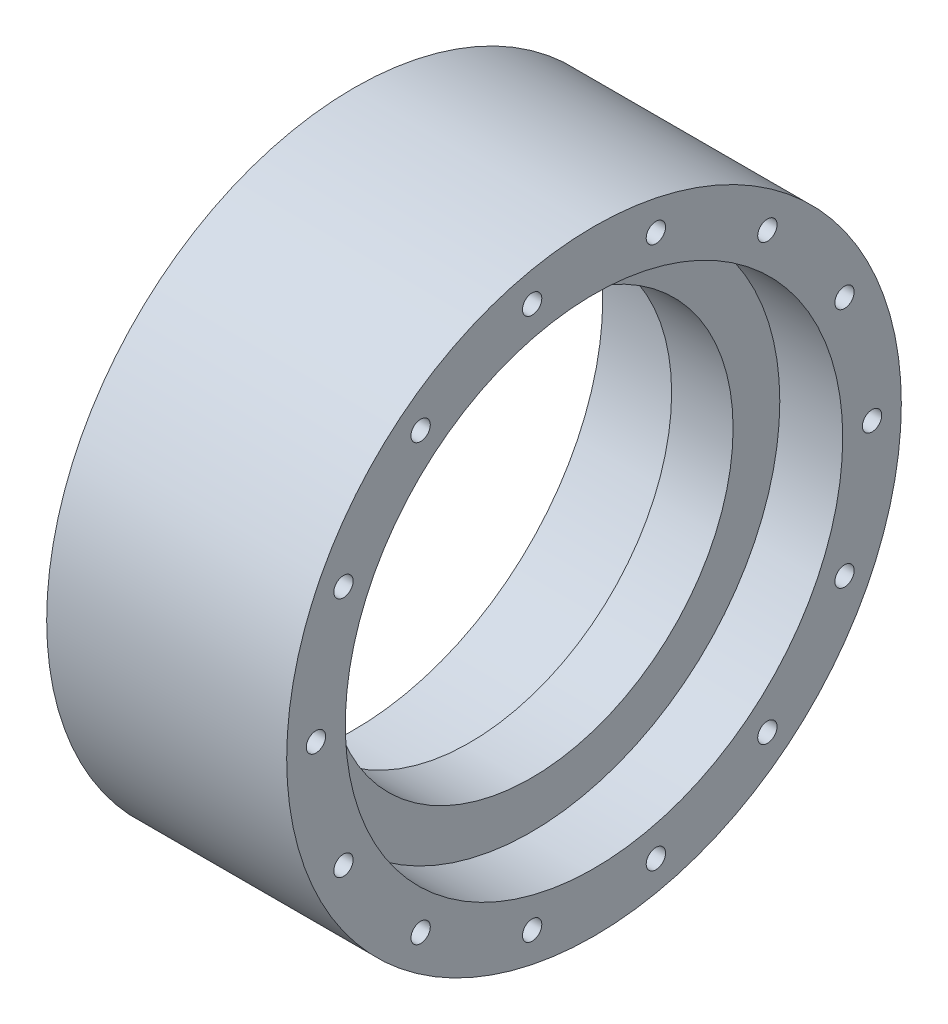
ISO-10303-21;
HEADER;
FILE_DESCRIPTION(('STEP AP214'),'2;1');
FILE_NAME('part.step','',(''),(''),'','','');
FILE_SCHEMA(('AUTOMOTIVE_DESIGN { 1 0 10303 214 1 1 1 1 }'));
ENDSEC;
DATA;
#1=APPLICATION_CONTEXT('core data for automotive mechanical design processes');
#2=APPLICATION_PROTOCOL_DEFINITION('international standard','automotive_design',2000,#1);
#3=PRODUCT_CONTEXT('',#1,'mechanical');
#4=PRODUCT('Part','Part','',(#3));
#5=PRODUCT_RELATED_PRODUCT_CATEGORY('part','',(#4));
#6=PRODUCT_DEFINITION_FORMATION('','',#4);
#7=PRODUCT_DEFINITION_CONTEXT('part definition',#1,'design');
#8=PRODUCT_DEFINITION('design','',#6,#7);
#9=PRODUCT_DEFINITION_SHAPE('','',#8);
#10=(LENGTH_UNIT() NAMED_UNIT(*) SI_UNIT(.MILLI.,.METRE.));
#11=(NAMED_UNIT(*) PLANE_ANGLE_UNIT() SI_UNIT($,.RADIAN.));
#12=(NAMED_UNIT(*) SI_UNIT($,.STERADIAN.) SOLID_ANGLE_UNIT());
#13=UNCERTAINTY_MEASURE_WITH_UNIT(LENGTH_MEASURE(1.E-05),#10,'distance_accuracy_value','');
#14=(GEOMETRIC_REPRESENTATION_CONTEXT(3) GLOBAL_UNCERTAINTY_ASSIGNED_CONTEXT((#13)) GLOBAL_UNIT_ASSIGNED_CONTEXT((#10,
#11,#12)) REPRESENTATION_CONTEXT('',''));
#15=CARTESIAN_POINT('',(0.,0.,0.));
#16=DIRECTION('',(0.,0.,1.));
#17=DIRECTION('',(1.,0.,0.));
#18=AXIS2_PLACEMENT_3D('',#15,#16,#17);
#19=CARTESIAN_POINT('',(0.5,0.,0.));
#20=DIRECTION('',(1.,0.,0.));
#21=DIRECTION('',(0.,1.,0.));
#22=AXIS2_PLACEMENT_3D('',#19,#20,#21);
#23=PLANE('',#22);
#24=CARTESIAN_POINT('',(0.5,0.,-47.5));
#25=DIRECTION('',(1.,0.,0.));
#26=DIRECTION('',(0.,0.,-1.));
#27=AXIS2_PLACEMENT_3D('',#24,#25,#26);
#28=CIRCLE('',#27,1.65);
#29=CARTESIAN_POINT('',(0.5,0.,-49.15));
#30=VERTEX_POINT('',#29);
#31=EDGE_CURVE('E11',#30,#30,#28,.T.);
#32=ORIENTED_EDGE('',*,*,#31,.T.);
#33=EDGE_LOOP('',(#32));
#34=FACE_BOUND('',#33,.T.);
#35=ADVANCED_FACE('F16',(#34),#23,.T.);
#36=CARTESIAN_POINT('',(0.5,0.,-47.5));
#37=DIRECTION('',(1.,0.,0.));
#38=DIRECTION('',(0.,0.,-1.));
#39=AXIS2_PLACEMENT_3D('',#36,#37,#38);
#40=CYLINDRICAL_SURFACE('',#39,1.65);
#41=CARTESIAN_POINT('',(20.5,0.,-47.5));
#42=DIRECTION('',(1.,0.,0.));
#43=DIRECTION('',(0.,0.,-1.));
#44=AXIS2_PLACEMENT_3D('',#41,#42,#43);
#45=CIRCLE('',#44,1.65);
#46=CARTESIAN_POINT('',(20.5,0.,-49.15));
#47=VERTEX_POINT('',#46);
#48=EDGE_CURVE('E271',#47,#47,#45,.T.);
#49=ORIENTED_EDGE('',*,*,#48,.T.);
#50=EDGE_LOOP('',(#49));
#51=FACE_BOUND('',#50,.T.);
#52=ORIENTED_EDGE('',*,*,#31,.F.);
#53=EDGE_LOOP('',(#52));
#54=FACE_BOUND('',#53,.T.);
#55=ADVANCED_FACE('F398',(#51,#54),#40,.F.);
#56=CARTESIAN_POINT('',(0.5,0.,0.));
#57=DIRECTION('',(1.,0.,0.));
#58=DIRECTION('',(0.,1.,0.));
#59=AXIS2_PLACEMENT_3D('',#56,#57,#58);
#60=PLANE('',#59);
#61=CARTESIAN_POINT('',(0.5,-46.3090758286366,10.5697443629249));
#62=DIRECTION('',(1.,0.,0.));
#63=DIRECTION('',(0.,0.,-1.));
#64=AXIS2_PLACEMENT_3D('',#61,#62,#63);
#65=CIRCLE('',#64,1.65);
#66=CARTESIAN_POINT('',(0.5,-46.3090758286366,8.91974436292494));
#67=VERTEX_POINT('',#66);
#68=EDGE_CURVE('E27',#67,#67,#65,.T.);
#69=ORIENTED_EDGE('',*,*,#68,.T.);
#70=EDGE_LOOP('',(#69));
#71=FACE_BOUND('',#70,.T.);
#72=ADVANCED_FACE('F402',(#71),#60,.T.);
#73=CARTESIAN_POINT('',(0.5,-46.3090758286366,10.5697443629249));
#74=DIRECTION('',(1.,0.,0.));
#75=DIRECTION('',(0.,0.,-1.));
#76=AXIS2_PLACEMENT_3D('',#73,#74,#75);
#77=CYLINDRICAL_SURFACE('',#76,1.65);
#78=CARTESIAN_POINT('',(20.5,-46.3090758286366,10.5697443629249));
#79=DIRECTION('',(1.,0.,0.));
#80=DIRECTION('',(0.,0.,-1.));
#81=AXIS2_PLACEMENT_3D('',#78,#79,#80);
#82=CIRCLE('',#81,1.65);
#83=CARTESIAN_POINT('',(20.5,-46.3090758286366,8.91974436292494));
#84=VERTEX_POINT('',#83);
#85=EDGE_CURVE('E219',#84,#84,#82,.T.);
#86=ORIENTED_EDGE('',*,*,#85,.T.);
#87=EDGE_LOOP('',(#86));
#88=FACE_BOUND('',#87,.T.);
#89=ORIENTED_EDGE('',*,*,#68,.F.);
#90=EDGE_LOOP('',(#89));
#91=FACE_BOUND('',#90,.T.);
#92=ADVANCED_FACE('F435',(#88,#91),#77,.F.);
#93=CARTESIAN_POINT('',(0.5,0.,0.));
#94=DIRECTION('',(1.,0.,0.));
#95=DIRECTION('',(0.,1.,0.));
#96=AXIS2_PLACEMENT_3D('',#93,#94,#95);
#97=PLANE('',#96);
#98=CARTESIAN_POINT('',(0.5,-46.3090758286366,-10.5697443629249));
#99=DIRECTION('',(1.,0.,0.));
#100=DIRECTION('',(0.,0.,-1.));
#101=AXIS2_PLACEMENT_3D('',#98,#99,#100);
#102=CIRCLE('',#101,1.65);
#103=CARTESIAN_POINT('',(0.5,-46.3090758286366,-12.2197443629249));
#104=VERTEX_POINT('',#103);
#105=EDGE_CURVE('E237',#104,#104,#102,.T.);
#106=ORIENTED_EDGE('',*,*,#105,.T.);
#107=EDGE_LOOP('',(#106));
#108=FACE_BOUND('',#107,.T.);
#109=ADVANCED_FACE('F477',(#108),#97,.T.);
#110=CARTESIAN_POINT('',(0.5,-46.3090758286366,-10.5697443629249));
#111=DIRECTION('',(1.,0.,0.));
#112=DIRECTION('',(0.,0.,-1.));
#113=AXIS2_PLACEMENT_3D('',#110,#111,#112);
#114=CYLINDRICAL_SURFACE('',#113,1.65);
#115=CARTESIAN_POINT('',(20.5,-46.3090758286366,-10.5697443629249));
#116=DIRECTION('',(1.,0.,0.));
#117=DIRECTION('',(0.,0.,-1.));
#118=AXIS2_PLACEMENT_3D('',#115,#116,#117);
#119=CIRCLE('',#118,1.65);
#120=CARTESIAN_POINT('',(20.5,-46.3090758286366,-12.2197443629249));
#121=VERTEX_POINT('',#120);
#122=EDGE_CURVE('E216',#121,#121,#119,.T.);
#123=ORIENTED_EDGE('',*,*,#122,.T.);
#124=EDGE_LOOP('',(#123));
#125=FACE_BOUND('',#124,.T.);
#126=ORIENTED_EDGE('',*,*,#105,.F.);
#127=EDGE_LOOP('',(#126));
#128=FACE_BOUND('',#127,.T.);
#129=ADVANCED_FACE('F482',(#125,#128),#114,.F.);
#130=CARTESIAN_POINT('',(0.5,0.,0.));
#131=DIRECTION('',(1.,0.,0.));
#132=DIRECTION('',(0.,1.,0.));
#133=AXIS2_PLACEMENT_3D('',#130,#131,#132);
#134=PLANE('',#133);
#135=CARTESIAN_POINT('',(0.5,-37.1369954172314,-29.6157655882898));
#136=DIRECTION('',(1.,0.,0.));
#137=DIRECTION('',(0.,0.,-1.));
#138=AXIS2_PLACEMENT_3D('',#135,#136,#137);
#139=CIRCLE('',#138,1.65);
#140=CARTESIAN_POINT('',(0.5,-37.1369954172314,-31.2657655882898));
#141=VERTEX_POINT('',#140);
#142=EDGE_CURVE('E130',#141,#141,#139,.T.);
#143=ORIENTED_EDGE('',*,*,#142,.T.);
#144=EDGE_LOOP('',(#143));
#145=FACE_BOUND('',#144,.T.);
#146=ADVANCED_FACE('F440',(#145),#134,.T.);
#147=CARTESIAN_POINT('',(0.5,-37.1369954172314,-29.6157655882898));
#148=DIRECTION('',(1.,0.,0.));
#149=DIRECTION('',(0.,0.,-1.));
#150=AXIS2_PLACEMENT_3D('',#147,#148,#149);
#151=CYLINDRICAL_SURFACE('',#150,1.65);
#152=CARTESIAN_POINT('',(20.5,-37.1369954172314,-29.6157655882898));
#153=DIRECTION('',(1.,0.,0.));
#154=DIRECTION('',(0.,0.,-1.));
#155=AXIS2_PLACEMENT_3D('',#152,#153,#154);
#156=CIRCLE('',#155,1.65);
#157=CARTESIAN_POINT('',(20.5,-37.1369954172314,-31.2657655882898));
#158=VERTEX_POINT('',#157);
#159=EDGE_CURVE('E205',#158,#158,#156,.T.);
#160=ORIENTED_EDGE('',*,*,#159,.T.);
#161=EDGE_LOOP('',(#160));
#162=FACE_BOUND('',#161,.T.);
#163=ORIENTED_EDGE('',*,*,#142,.F.);
#164=EDGE_LOOP('',(#163));
#165=FACE_BOUND('',#164,.T.);
#166=ADVANCED_FACE('F437',(#162,#165),#151,.F.);
#167=CARTESIAN_POINT('',(0.5,0.,0.));
#168=DIRECTION('',(1.,0.,0.));
#169=DIRECTION('',(0.,1.,0.));
#170=AXIS2_PLACEMENT_3D('',#167,#168,#169);
#171=PLANE('',#170);
#172=CARTESIAN_POINT('',(0.5,-20.609477608084,-42.7960212253649));
#173=DIRECTION('',(1.,0.,0.));
#174=DIRECTION('',(0.,0.,-1.));
#175=AXIS2_PLACEMENT_3D('',#172,#173,#174);
#176=CIRCLE('',#175,1.65);
#177=CARTESIAN_POINT('',(0.5,-20.609477608084,-44.4460212253649));
#178=VERTEX_POINT('',#177);
#179=EDGE_CURVE('E140',#178,#178,#176,.T.);
#180=ORIENTED_EDGE('',*,*,#179,.T.);
#181=EDGE_LOOP('',(#180));
#182=FACE_BOUND('',#181,.T.);
#183=ADVANCED_FACE('F431',(#182),#171,.T.);
#184=CARTESIAN_POINT('',(0.5,-20.609477608084,-42.7960212253649));
#185=DIRECTION('',(1.,0.,0.));
#186=DIRECTION('',(0.,0.,-1.));
#187=AXIS2_PLACEMENT_3D('',#184,#185,#186);
#188=CYLINDRICAL_SURFACE('',#187,1.65);
#189=CARTESIAN_POINT('',(20.5,-20.609477608084,-42.7960212253649));
#190=DIRECTION('',(1.,0.,0.));
#191=DIRECTION('',(0.,0.,-1.));
#192=AXIS2_PLACEMENT_3D('',#189,#190,#191);
#193=CIRCLE('',#192,1.65);
#194=CARTESIAN_POINT('',(20.5,-20.609477608084,-44.4460212253649));
#195=VERTEX_POINT('',#194);
#196=EDGE_CURVE('E196',#195,#195,#193,.T.);
#197=ORIENTED_EDGE('',*,*,#196,.T.);
#198=EDGE_LOOP('',(#197));
#199=FACE_BOUND('',#198,.T.);
#200=ORIENTED_EDGE('',*,*,#179,.F.);
#201=EDGE_LOOP('',(#200));
#202=FACE_BOUND('',#201,.T.);
#203=ADVANCED_FACE('F427',(#199,#202),#188,.F.);
#204=CARTESIAN_POINT('',(0.5,0.,0.));
#205=DIRECTION('',(1.,0.,0.));
#206=DIRECTION('',(0.,1.,0.));
#207=AXIS2_PLACEMENT_3D('',#204,#205,#206);
#208=PLANE('',#207);
#209=CARTESIAN_POINT('',(0.5,20.609477608084,-42.7960212253649));
#210=DIRECTION('',(1.,0.,0.));
#211=DIRECTION('',(0.,0.,-1.));
#212=AXIS2_PLACEMENT_3D('',#209,#210,#211);
#213=CIRCLE('',#212,1.65);
#214=CARTESIAN_POINT('',(0.5,20.609477608084,-44.4460212253649));
#215=VERTEX_POINT('',#214);
#216=EDGE_CURVE('E244',#215,#215,#213,.T.);
#217=ORIENTED_EDGE('',*,*,#216,.T.);
#218=EDGE_LOOP('',(#217));
#219=FACE_BOUND('',#218,.T.);
#220=ADVANCED_FACE('F430',(#219),#208,.T.);
#221=CARTESIAN_POINT('',(0.5,20.609477608084,-42.7960212253649));
#222=DIRECTION('',(1.,0.,0.));
#223=DIRECTION('',(0.,0.,-1.));
#224=AXIS2_PLACEMENT_3D('',#221,#222,#223);
#225=CYLINDRICAL_SURFACE('',#224,1.65);
#226=CARTESIAN_POINT('',(20.5,20.609477608084,-42.7960212253649));
#227=DIRECTION('',(1.,0.,0.));
#228=DIRECTION('',(0.,0.,-1.));
#229=AXIS2_PLACEMENT_3D('',#226,#227,#228);
#230=CIRCLE('',#229,1.65);
#231=CARTESIAN_POINT('',(20.5,20.609477608084,-44.4460212253649));
#232=VERTEX_POINT('',#231);
#233=EDGE_CURVE('E190',#232,#232,#230,.T.);
#234=ORIENTED_EDGE('',*,*,#233,.T.);
#235=EDGE_LOOP('',(#234));
#236=FACE_BOUND('',#235,.T.);
#237=ORIENTED_EDGE('',*,*,#216,.F.);
#238=EDGE_LOOP('',(#237));
#239=FACE_BOUND('',#238,.T.);
#240=ADVANCED_FACE('F191',(#236,#239),#225,.F.);
#241=CARTESIAN_POINT('',(0.5,0.,0.));
#242=DIRECTION('',(1.,0.,0.));
#243=DIRECTION('',(0.,1.,0.));
#244=AXIS2_PLACEMENT_3D('',#241,#242,#243);
#245=PLANE('',#244);
#246=CARTESIAN_POINT('',(0.5,37.1369954172314,-29.6157655882898));
#247=DIRECTION('',(1.,0.,0.));
#248=DIRECTION('',(0.,0.,-1.));
#249=AXIS2_PLACEMENT_3D('',#246,#247,#248);
#250=CIRCLE('',#249,1.65);
#251=CARTESIAN_POINT('',(0.5,37.1369954172314,-31.2657655882898));
#252=VERTEX_POINT('',#251);
#253=EDGE_CURVE('E234',#252,#252,#250,.T.);
#254=ORIENTED_EDGE('',*,*,#253,.T.);
#255=EDGE_LOOP('',(#254));
#256=FACE_BOUND('',#255,.T.);
#257=ADVANCED_FACE('F411',(#256),#245,.T.);
#258=CARTESIAN_POINT('',(0.5,37.1369954172314,-29.6157655882898));
#259=DIRECTION('',(1.,0.,0.));
#260=DIRECTION('',(0.,0.,-1.));
#261=AXIS2_PLACEMENT_3D('',#258,#259,#260);
#262=CYLINDRICAL_SURFACE('',#261,1.65);
#263=CARTESIAN_POINT('',(20.5,37.1369954172314,-29.6157655882898));
#264=DIRECTION('',(1.,0.,0.));
#265=DIRECTION('',(0.,0.,-1.));
#266=AXIS2_PLACEMENT_3D('',#263,#264,#265);
#267=CIRCLE('',#266,1.65);
#268=CARTESIAN_POINT('',(20.5,37.1369954172314,-31.2657655882898));
#269=VERTEX_POINT('',#268);
#270=EDGE_CURVE('E195',#269,#269,#267,.T.);
#271=ORIENTED_EDGE('',*,*,#270,.T.);
#272=EDGE_LOOP('',(#271));
#273=FACE_BOUND('',#272,.T.);
#274=ORIENTED_EDGE('',*,*,#253,.F.);
#275=EDGE_LOOP('',(#274));
#276=FACE_BOUND('',#275,.T.);
#277=ADVANCED_FACE('F407',(#273,#276),#262,.F.);
#278=CARTESIAN_POINT('',(0.5,0.,0.));
#279=DIRECTION('',(1.,0.,0.));
#280=DIRECTION('',(0.,1.,0.));
#281=AXIS2_PLACEMENT_3D('',#278,#279,#280);
#282=PLANE('',#281);
#283=CARTESIAN_POINT('',(0.5,46.3090758286366,-10.5697443629249));
#284=DIRECTION('',(1.,0.,0.));
#285=DIRECTION('',(0.,0.,-1.));
#286=AXIS2_PLACEMENT_3D('',#283,#284,#285);
#287=CIRCLE('',#286,1.65);
#288=CARTESIAN_POINT('',(0.5,46.3090758286366,-12.2197443629249));
#289=VERTEX_POINT('',#288);
#290=EDGE_CURVE('E231',#289,#289,#287,.T.);
#291=ORIENTED_EDGE('',*,*,#290,.T.);
#292=EDGE_LOOP('',(#291));
#293=FACE_BOUND('',#292,.T.);
#294=ADVANCED_FACE('F410',(#293),#282,.T.);
#295=CARTESIAN_POINT('',(0.5,46.3090758286366,-10.5697443629249));
#296=DIRECTION('',(1.,0.,0.));
#297=DIRECTION('',(0.,0.,-1.));
#298=AXIS2_PLACEMENT_3D('',#295,#296,#297);
#299=CYLINDRICAL_SURFACE('',#298,1.65);
#300=CARTESIAN_POINT('',(20.5,46.3090758286366,-10.5697443629249));
#301=DIRECTION('',(1.,0.,0.));
#302=DIRECTION('',(0.,0.,-1.));
#303=AXIS2_PLACEMENT_3D('',#300,#301,#302);
#304=CIRCLE('',#303,1.65);
#305=CARTESIAN_POINT('',(20.5,46.3090758286366,-12.2197443629249));
#306=VERTEX_POINT('',#305);
#307=EDGE_CURVE('E203',#306,#306,#304,.T.);
#308=ORIENTED_EDGE('',*,*,#307,.T.);
#309=EDGE_LOOP('',(#308));
#310=FACE_BOUND('',#309,.T.);
#311=ORIENTED_EDGE('',*,*,#290,.F.);
#312=EDGE_LOOP('',(#311));
#313=FACE_BOUND('',#312,.T.);
#314=ADVANCED_FACE('F446',(#310,#313),#299,.F.);
#315=CARTESIAN_POINT('',(0.5,0.,0.));
#316=DIRECTION('',(1.,0.,0.));
#317=DIRECTION('',(0.,1.,0.));
#318=AXIS2_PLACEMENT_3D('',#315,#316,#317);
#319=PLANE('',#318);
#320=CARTESIAN_POINT('',(0.5,46.3090758286366,10.5697443629249));
#321=DIRECTION('',(1.,0.,0.));
#322=DIRECTION('',(0.,0.,-1.));
#323=AXIS2_PLACEMENT_3D('',#320,#321,#322);
#324=CIRCLE('',#323,1.65);
#325=CARTESIAN_POINT('',(0.5,46.3090758286366,8.91974436292492));
#326=VERTEX_POINT('',#325);
#327=EDGE_CURVE('E228',#326,#326,#324,.T.);
#328=ORIENTED_EDGE('',*,*,#327,.T.);
#329=EDGE_LOOP('',(#328));
#330=FACE_BOUND('',#329,.T.);
#331=ADVANCED_FACE('F448',(#330),#319,.T.);
#332=CARTESIAN_POINT('',(0.5,46.3090758286366,10.5697443629249));
#333=DIRECTION('',(1.,0.,0.));
#334=DIRECTION('',(0.,0.,-1.));
#335=AXIS2_PLACEMENT_3D('',#332,#333,#334);
#336=CYLINDRICAL_SURFACE('',#335,1.65);
#337=CARTESIAN_POINT('',(20.5,46.3090758286366,10.5697443629249));
#338=DIRECTION('',(1.,0.,0.));
#339=DIRECTION('',(0.,0.,-1.));
#340=AXIS2_PLACEMENT_3D('',#337,#338,#339);
#341=CIRCLE('',#340,1.65);
#342=CARTESIAN_POINT('',(20.5,46.3090758286366,8.91974436292492));
#343=VERTEX_POINT('',#342);
#344=EDGE_CURVE('E252',#343,#343,#341,.T.);
#345=ORIENTED_EDGE('',*,*,#344,.T.);
#346=EDGE_LOOP('',(#345));
#347=FACE_BOUND('',#346,.T.);
#348=ORIENTED_EDGE('',*,*,#327,.F.);
#349=EDGE_LOOP('',(#348));
#350=FACE_BOUND('',#349,.T.);
#351=ADVANCED_FACE('F417',(#347,#350),#336,.F.);
#352=CARTESIAN_POINT('',(0.5,0.,0.));
#353=DIRECTION('',(1.,0.,0.));
#354=DIRECTION('',(0.,1.,0.));
#355=AXIS2_PLACEMENT_3D('',#352,#353,#354);
#356=PLANE('',#355);
#357=CARTESIAN_POINT('',(0.5,37.1369954172314,29.6157655882898));
#358=DIRECTION('',(1.,0.,0.));
#359=DIRECTION('',(0.,0.,-1.));
#360=AXIS2_PLACEMENT_3D('',#357,#358,#359);
#361=CIRCLE('',#360,1.65);
#362=CARTESIAN_POINT('',(0.5,37.1369954172314,27.9657655882899));
#363=VERTEX_POINT('',#362);
#364=EDGE_CURVE('E225',#363,#363,#361,.T.);
#365=ORIENTED_EDGE('',*,*,#364,.T.);
#366=EDGE_LOOP('',(#365));
#367=FACE_BOUND('',#366,.T.);
#368=ADVANCED_FACE('F413',(#367),#356,.T.);
#369=CARTESIAN_POINT('',(0.5,37.1369954172314,29.6157655882898));
#370=DIRECTION('',(1.,0.,0.));
#371=DIRECTION('',(0.,0.,-1.));
#372=AXIS2_PLACEMENT_3D('',#369,#370,#371);
#373=CYLINDRICAL_SURFACE('',#372,1.65);
#374=CARTESIAN_POINT('',(20.5,37.1369954172314,29.6157655882898));
#375=DIRECTION('',(1.,0.,0.));
#376=DIRECTION('',(0.,0.,-1.));
#377=AXIS2_PLACEMENT_3D('',#374,#375,#376);
#378=CIRCLE('',#377,1.65);
#379=CARTESIAN_POINT('',(20.5,37.1369954172314,27.9657655882899));
#380=VERTEX_POINT('',#379);
#381=EDGE_CURVE('E256',#380,#380,#378,.T.);
#382=ORIENTED_EDGE('',*,*,#381,.T.);
#383=EDGE_LOOP('',(#382));
#384=FACE_BOUND('',#383,.T.);
#385=ORIENTED_EDGE('',*,*,#364,.F.);
#386=EDGE_LOOP('',(#385));
#387=FACE_BOUND('',#386,.T.);
#388=ADVANCED_FACE('F416',(#384,#387),#373,.F.);
#389=CARTESIAN_POINT('',(0.5,0.,0.));
#390=DIRECTION('',(1.,0.,0.));
#391=DIRECTION('',(0.,1.,0.));
#392=AXIS2_PLACEMENT_3D('',#389,#390,#391);
#393=PLANE('',#392);
#394=CARTESIAN_POINT('',(0.5,20.609477608084,42.7960212253649));
#395=DIRECTION('',(1.,0.,0.));
#396=DIRECTION('',(0.,0.,-1.));
#397=AXIS2_PLACEMENT_3D('',#394,#395,#396);
#398=CIRCLE('',#397,1.65);
#399=CARTESIAN_POINT('',(0.5,20.609477608084,41.1460212253649));
#400=VERTEX_POINT('',#399);
#401=EDGE_CURVE('E158',#400,#400,#398,.T.);
#402=ORIENTED_EDGE('',*,*,#401,.T.);
#403=EDGE_LOOP('',(#402));
#404=FACE_BOUND('',#403,.T.);
#405=ADVANCED_FACE('F425',(#404),#393,.T.);
#406=CARTESIAN_POINT('',(0.5,20.609477608084,42.7960212253649));
#407=DIRECTION('',(1.,0.,0.));
#408=DIRECTION('',(0.,0.,-1.));
#409=AXIS2_PLACEMENT_3D('',#406,#407,#408);
#410=CYLINDRICAL_SURFACE('',#409,1.65);
#411=CARTESIAN_POINT('',(20.5,20.609477608084,42.7960212253649));
#412=DIRECTION('',(1.,0.,0.));
#413=DIRECTION('',(0.,0.,-1.));
#414=AXIS2_PLACEMENT_3D('',#411,#412,#413);
#415=CIRCLE('',#414,1.65);
#416=CARTESIAN_POINT('',(20.5,20.609477608084,41.1460212253649));
#417=VERTEX_POINT('',#416);
#418=EDGE_CURVE('E240',#417,#417,#415,.T.);
#419=ORIENTED_EDGE('',*,*,#418,.T.);
#420=EDGE_LOOP('',(#419));
#421=FACE_BOUND('',#420,.T.);
#422=ORIENTED_EDGE('',*,*,#401,.F.);
#423=EDGE_LOOP('',(#422));
#424=FACE_BOUND('',#423,.T.);
#425=ADVANCED_FACE('F537',(#421,#424),#410,.F.);
#426=CARTESIAN_POINT('',(0.5,0.,0.));
#427=DIRECTION('',(1.,0.,0.));
#428=DIRECTION('',(0.,1.,0.));
#429=AXIS2_PLACEMENT_3D('',#426,#427,#428);
#430=PLANE('',#429);
#431=CARTESIAN_POINT('',(0.5,0.,47.5));
#432=DIRECTION('',(1.,0.,0.));
#433=DIRECTION('',(0.,0.,-1.));
#434=AXIS2_PLACEMENT_3D('',#431,#432,#433);
#435=CIRCLE('',#434,1.65);
#436=CARTESIAN_POINT('',(0.5,0.,45.85));
#437=VERTEX_POINT('',#436);
#438=EDGE_CURVE('E164',#437,#437,#435,.T.);
#439=ORIENTED_EDGE('',*,*,#438,.T.);
#440=EDGE_LOOP('',(#439));
#441=FACE_BOUND('',#440,.T.);
#442=ADVANCED_FACE('F499',(#441),#430,.T.);
#443=CARTESIAN_POINT('',(0.5,0.,47.5));
#444=DIRECTION('',(1.,0.,0.));
#445=DIRECTION('',(0.,0.,-1.));
#446=AXIS2_PLACEMENT_3D('',#443,#444,#445);
#447=CYLINDRICAL_SURFACE('',#446,1.65);
#448=CARTESIAN_POINT('',(20.5,0.,47.5));
#449=DIRECTION('',(1.,0.,0.));
#450=DIRECTION('',(0.,0.,-1.));
#451=AXIS2_PLACEMENT_3D('',#448,#449,#450);
#452=CIRCLE('',#451,1.65);
#453=CARTESIAN_POINT('',(20.5,0.,45.85));
#454=VERTEX_POINT('',#453);
#455=EDGE_CURVE('E114',#454,#454,#452,.T.);
#456=ORIENTED_EDGE('',*,*,#455,.T.);
#457=EDGE_LOOP('',(#456));
#458=FACE_BOUND('',#457,.T.);
#459=ORIENTED_EDGE('',*,*,#438,.F.);
#460=EDGE_LOOP('',(#459));
#461=FACE_BOUND('',#460,.T.);
#462=ADVANCED_FACE('F496',(#458,#461),#447,.F.);
#463=CARTESIAN_POINT('',(0.5,0.,0.));
#464=DIRECTION('',(1.,0.,0.));
#465=DIRECTION('',(0.,1.,0.));
#466=AXIS2_PLACEMENT_3D('',#463,#464,#465);
#467=PLANE('',#466);
#468=CARTESIAN_POINT('',(0.5,-20.609477608084,42.7960212253649));
#469=DIRECTION('',(1.,0.,0.));
#470=DIRECTION('',(0.,0.,-1.));
#471=AXIS2_PLACEMENT_3D('',#468,#469,#470);
#472=CIRCLE('',#471,1.65);
#473=CARTESIAN_POINT('',(0.5,-20.609477608084,41.1460212253649));
#474=VERTEX_POINT('',#473);
#475=EDGE_CURVE('E173',#474,#474,#472,.T.);
#476=ORIENTED_EDGE('',*,*,#475,.T.);
#477=EDGE_LOOP('',(#476));
#478=FACE_BOUND('',#477,.T.);
#479=ADVANCED_FACE('F445',(#478),#467,.T.);
#480=CARTESIAN_POINT('',(0.5,-20.609477608084,42.7960212253649));
#481=DIRECTION('',(1.,0.,0.));
#482=DIRECTION('',(0.,0.,-1.));
#483=AXIS2_PLACEMENT_3D('',#480,#481,#482);
#484=CYLINDRICAL_SURFACE('',#483,1.65);
#485=CARTESIAN_POINT('',(20.5,-20.609477608084,42.7960212253649));
#486=DIRECTION('',(1.,0.,0.));
#487=DIRECTION('',(0.,0.,-1.));
#488=AXIS2_PLACEMENT_3D('',#485,#486,#487);
#489=CIRCLE('',#488,1.65);
#490=CARTESIAN_POINT('',(20.5,-20.609477608084,41.1460212253649));
#491=VERTEX_POINT('',#490);
#492=EDGE_CURVE('E20',#491,#491,#489,.T.);
#493=ORIENTED_EDGE('',*,*,#492,.T.);
#494=EDGE_LOOP('',(#493));
#495=FACE_BOUND('',#494,.T.);
#496=ORIENTED_EDGE('',*,*,#475,.F.);
#497=EDGE_LOOP('',(#496));
#498=FACE_BOUND('',#497,.T.);
#499=ADVANCED_FACE('F442',(#495,#498),#484,.F.);
#500=CARTESIAN_POINT('',(0.5,0.,0.));
#501=DIRECTION('',(1.,0.,0.));
#502=DIRECTION('',(0.,1.,0.));
#503=AXIS2_PLACEMENT_3D('',#500,#501,#502);
#504=PLANE('',#503);
#505=CARTESIAN_POINT('',(0.5,-37.1369954172314,29.6157655882898));
#506=DIRECTION('',(1.,0.,0.));
#507=DIRECTION('',(0.,0.,-1.));
#508=AXIS2_PLACEMENT_3D('',#505,#506,#507);
#509=CIRCLE('',#508,1.65);
#510=CARTESIAN_POINT('',(0.5,-37.1369954172314,27.9657655882899));
#511=VERTEX_POINT('',#510);
#512=EDGE_CURVE('E214',#511,#511,#509,.T.);
#513=ORIENTED_EDGE('',*,*,#512,.T.);
#514=EDGE_LOOP('',(#513));
#515=FACE_BOUND('',#514,.T.);
#516=ADVANCED_FACE('F444',(#515),#504,.T.);
#517=CARTESIAN_POINT('',(0.5,-37.1369954172314,29.6157655882898));
#518=DIRECTION('',(1.,0.,0.));
#519=DIRECTION('',(0.,0.,-1.));
#520=AXIS2_PLACEMENT_3D('',#517,#518,#519);
#521=CYLINDRICAL_SURFACE('',#520,1.65);
#522=CARTESIAN_POINT('',(20.5,-37.1369954172314,29.6157655882898));
#523=DIRECTION('',(1.,0.,0.));
#524=DIRECTION('',(0.,0.,-1.));
#525=AXIS2_PLACEMENT_3D('',#522,#523,#524);
#526=CIRCLE('',#525,1.65);
#527=CARTESIAN_POINT('',(20.5,-37.1369954172314,27.9657655882899));
#528=VERTEX_POINT('',#527);
#529=EDGE_CURVE('E243',#528,#528,#526,.T.);
#530=ORIENTED_EDGE('',*,*,#529,.T.);
#531=EDGE_LOOP('',(#530));
#532=FACE_BOUND('',#531,.T.);
#533=ORIENTED_EDGE('',*,*,#512,.F.);
#534=EDGE_LOOP('',(#533));
#535=FACE_BOUND('',#534,.T.);
#536=ADVANCED_FACE('F492',(#532,#535),#521,.F.);
#537=CARTESIAN_POINT('',(-0.75,0.,0.));
#538=DIRECTION('',(1.,0.,0.));
#539=DIRECTION('',(0.,1.,0.));
#540=AXIS2_PLACEMENT_3D('',#537,#538,#539);
#541=PLANE('',#540);
#542=CARTESIAN_POINT('',(-0.75,0.,0.));
#543=DIRECTION('',(1.,0.,0.));
#544=DIRECTION('',(0.,0.,-1.));
#545=AXIS2_PLACEMENT_3D('',#542,#543,#544);
#546=CIRCLE('',#545,42.49);
#547=CARTESIAN_POINT('',(-0.75,0.,-42.49));
#548=VERTEX_POINT('',#547);
#549=EDGE_CURVE('E257',#548,#548,#546,.T.);
#550=ORIENTED_EDGE('',*,*,#549,.F.);
#551=EDGE_LOOP('',(#550));
#552=FACE_BOUND('',#551,.T.);
#553=CARTESIAN_POINT('',(-0.75,0.,0.));
#554=DIRECTION('',(1.,0.,0.));
#555=DIRECTION('',(0.,0.,-1.));
#556=AXIS2_PLACEMENT_3D('',#553,#554,#555);
#557=CIRCLE('',#556,34.512075);
#558=CARTESIAN_POINT('',(-0.75,0.,-34.512075));
#559=VERTEX_POINT('',#558);
#560=EDGE_CURVE('E211',#559,#559,#557,.T.);
#561=ORIENTED_EDGE('',*,*,#560,.T.);
#562=EDGE_LOOP('',(#561));
#563=FACE_BOUND('',#562,.T.);
#564=ADVANCED_FACE('F18',(#552,#563),#541,.F.);
#565=CARTESIAN_POINT('',(9.75,0.,0.));
#566=DIRECTION('',(1.,0.,0.));
#567=DIRECTION('',(0.,1.,0.));
#568=AXIS2_PLACEMENT_3D('',#565,#566,#567);
#569=PLANE('',#568);
#570=CARTESIAN_POINT('',(9.75,0.,0.));
#571=DIRECTION('',(1.,0.,0.));
#572=DIRECTION('',(0.,0.,-1.));
#573=AXIS2_PLACEMENT_3D('',#570,#571,#572);
#574=CIRCLE('',#573,42.49);
#575=CARTESIAN_POINT('',(9.75,0.,-42.49));
#576=VERTEX_POINT('',#575);
#577=EDGE_CURVE('E260',#576,#576,#574,.T.);
#578=ORIENTED_EDGE('',*,*,#577,.T.);
#579=EDGE_LOOP('',(#578));
#580=FACE_BOUND('',#579,.T.);
#581=CARTESIAN_POINT('',(9.75,0.,0.));
#582=DIRECTION('',(1.,0.,0.));
#583=DIRECTION('',(0.,0.,-1.));
#584=AXIS2_PLACEMENT_3D('',#581,#582,#583);
#585=CIRCLE('',#584,34.512075);
#586=CARTESIAN_POINT('',(9.75,0.,-34.512075));
#587=VERTEX_POINT('',#586);
#588=EDGE_CURVE('E215',#587,#587,#585,.T.);
#589=ORIENTED_EDGE('',*,*,#588,.F.);
#590=EDGE_LOOP('',(#589));
#591=FACE_BOUND('',#590,.T.);
#592=ADVANCED_FACE('F377',(#580,#591),#569,.T.);
#593=CARTESIAN_POINT('',(8.25,0.,0.));
#594=DIRECTION('',(-1.,0.,0.));
#595=DIRECTION('',(0.,0.,1.));
#596=AXIS2_PLACEMENT_3D('',#593,#594,#595);
#597=CYLINDRICAL_SURFACE('',#596,34.512075);
#598=ORIENTED_EDGE('',*,*,#560,.F.);
#599=EDGE_LOOP('',(#598));
#600=FACE_BOUND('',#599,.T.);
#601=ORIENTED_EDGE('',*,*,#588,.T.);
#602=EDGE_LOOP('',(#601));
#603=FACE_BOUND('',#602,.T.);
#604=ADVANCED_FACE('F503',(#600,#603),#597,.F.);
#605=CARTESIAN_POINT('',(-20.5,0.,0.));
#606=DIRECTION('',(1.,0.,0.));
#607=DIRECTION('',(0.,1.,0.));
#608=AXIS2_PLACEMENT_3D('',#605,#606,#607);
#609=PLANE('',#608);
#610=CARTESIAN_POINT('',(-20.5,0.,0.));
#611=DIRECTION('',(1.,0.,0.));
#612=DIRECTION('',(0.,0.,-1.));
#613=AXIS2_PLACEMENT_3D('',#610,#611,#612);
#614=CIRCLE('',#613,52.5);
#615=CARTESIAN_POINT('',(-20.5,0.,-52.5));
#616=VERTEX_POINT('',#615);
#617=EDGE_CURVE('E276',#616,#616,#614,.T.);
#618=ORIENTED_EDGE('',*,*,#617,.F.);
#619=EDGE_LOOP('',(#618));
#620=FACE_BOUND('',#619,.T.);
#621=CARTESIAN_POINT('',(-20.5,0.,0.));
#622=DIRECTION('',(1.,0.,0.));
#623=DIRECTION('',(0.,0.,-1.));
#624=AXIS2_PLACEMENT_3D('',#621,#622,#623);
#625=CIRCLE('',#624,42.49);
#626=CARTESIAN_POINT('',(-20.5,0.,-42.49));
#627=VERTEX_POINT('',#626);
#628=EDGE_CURVE('E261',#627,#627,#625,.T.);
#629=ORIENTED_EDGE('',*,*,#628,.T.);
#630=EDGE_LOOP('',(#629));
#631=FACE_BOUND('',#630,.T.);
#632=ADVANCED_FACE('F421',(#620,#631),#609,.F.);
#633=CARTESIAN_POINT('',(20.5,0.,0.));
#634=DIRECTION('',(1.,0.,0.));
#635=DIRECTION('',(0.,1.,0.));
#636=AXIS2_PLACEMENT_3D('',#633,#634,#635);
#637=PLANE('',#636);
#638=CARTESIAN_POINT('',(20.5,0.,0.));
#639=DIRECTION('',(1.,0.,0.));
#640=DIRECTION('',(0.,0.,-1.));
#641=AXIS2_PLACEMENT_3D('',#638,#639,#640);
#642=CIRCLE('',#641,52.5);
#643=CARTESIAN_POINT('',(20.5,0.,-52.5));
#644=VERTEX_POINT('',#643);
#645=EDGE_CURVE('E209',#644,#644,#642,.T.);
#646=ORIENTED_EDGE('',*,*,#645,.T.);
#647=EDGE_LOOP('',(#646));
#648=FACE_BOUND('',#647,.T.);
#649=CARTESIAN_POINT('',(20.5,0.,0.));
#650=DIRECTION('',(1.,0.,0.));
#651=DIRECTION('',(0.,0.,-1.));
#652=AXIS2_PLACEMENT_3D('',#649,#650,#651);
#653=CIRCLE('',#652,42.49);
#654=CARTESIAN_POINT('',(20.5,0.,-42.49));
#655=VERTEX_POINT('',#654);
#656=EDGE_CURVE('E281',#655,#655,#653,.T.);
#657=ORIENTED_EDGE('',*,*,#656,.F.);
#658=EDGE_LOOP('',(#657));
#659=FACE_BOUND('',#658,.T.);
#660=ORIENTED_EDGE('',*,*,#529,.F.);
#661=EDGE_LOOP('',(#660));
#662=FACE_BOUND('',#661,.T.);
#663=ORIENTED_EDGE('',*,*,#492,.F.);
#664=EDGE_LOOP('',(#663));
#665=FACE_BOUND('',#664,.T.);
#666=ORIENTED_EDGE('',*,*,#455,.F.);
#667=EDGE_LOOP('',(#666));
#668=FACE_BOUND('',#667,.T.);
#669=ORIENTED_EDGE('',*,*,#418,.F.);
#670=EDGE_LOOP('',(#669));
#671=FACE_BOUND('',#670,.T.);
#672=ORIENTED_EDGE('',*,*,#381,.F.);
#673=EDGE_LOOP('',(#672));
#674=FACE_BOUND('',#673,.T.);
#675=ORIENTED_EDGE('',*,*,#344,.F.);
#676=EDGE_LOOP('',(#675));
#677=FACE_BOUND('',#676,.T.);
#678=ORIENTED_EDGE('',*,*,#307,.F.);
#679=EDGE_LOOP('',(#678));
#680=FACE_BOUND('',#679,.T.);
#681=ORIENTED_EDGE('',*,*,#270,.F.);
#682=EDGE_LOOP('',(#681));
#683=FACE_BOUND('',#682,.T.);
#684=ORIENTED_EDGE('',*,*,#233,.F.);
#685=EDGE_LOOP('',(#684));
#686=FACE_BOUND('',#685,.T.);
#687=ORIENTED_EDGE('',*,*,#196,.F.);
#688=EDGE_LOOP('',(#687));
#689=FACE_BOUND('',#688,.T.);
#690=ORIENTED_EDGE('',*,*,#159,.F.);
#691=EDGE_LOOP('',(#690));
#692=FACE_BOUND('',#691,.T.);
#693=ORIENTED_EDGE('',*,*,#122,.F.);
#694=EDGE_LOOP('',(#693));
#695=FACE_BOUND('',#694,.T.);
#696=ORIENTED_EDGE('',*,*,#85,.F.);
#697=EDGE_LOOP('',(#696));
#698=FACE_BOUND('',#697,.T.);
#699=ORIENTED_EDGE('',*,*,#48,.F.);
#700=EDGE_LOOP('',(#699));
#701=FACE_BOUND('',#700,.T.);
#702=ADVANCED_FACE('F393',(#648,#659,#662,#665,#668,#671,#674,#677,#680,#683,#686,#689,#692,
#695,#698,#701),#637,.T.);
#703=CARTESIAN_POINT('',(20.5,0.,0.));
#704=DIRECTION('',(-1.,0.,0.));
#705=DIRECTION('',(0.,0.,1.));
#706=AXIS2_PLACEMENT_3D('',#703,#704,#705);
#707=CYLINDRICAL_SURFACE('',#706,52.5);
#708=ORIENTED_EDGE('',*,*,#617,.T.);
#709=EDGE_LOOP('',(#708));
#710=FACE_BOUND('',#709,.T.);
#711=ORIENTED_EDGE('',*,*,#645,.F.);
#712=EDGE_LOOP('',(#711));
#713=FACE_BOUND('',#712,.T.);
#714=ADVANCED_FACE('F384',(#710,#713),#707,.T.);
#715=CARTESIAN_POINT('',(20.5,0.,0.));
#716=DIRECTION('',(-1.,0.,0.));
#717=DIRECTION('',(0.,0.,1.));
#718=AXIS2_PLACEMENT_3D('',#715,#716,#717);
#719=CYLINDRICAL_SURFACE('',#718,42.49);
#720=ORIENTED_EDGE('',*,*,#656,.T.);
#721=EDGE_LOOP('',(#720));
#722=FACE_BOUND('',#721,.T.);
#723=ORIENTED_EDGE('',*,*,#577,.F.);
#724=EDGE_LOOP('',(#723));
#725=FACE_BOUND('',#724,.T.);
#726=ADVANCED_FACE('F381',(#722,#725),#719,.F.);
#727=CARTESIAN_POINT('',(20.5,0.,0.));
#728=DIRECTION('',(-1.,0.,0.));
#729=DIRECTION('',(0.,0.,1.));
#730=AXIS2_PLACEMENT_3D('',#727,#728,#729);
#731=CYLINDRICAL_SURFACE('',#730,42.49);
#732=ORIENTED_EDGE('',*,*,#549,.T.);
#733=EDGE_LOOP('',(#732));
#734=FACE_BOUND('',#733,.T.);
#735=ORIENTED_EDGE('',*,*,#628,.F.);
#736=EDGE_LOOP('',(#735));
#737=FACE_BOUND('',#736,.T.);
#738=ADVANCED_FACE('F383',(#734,#737),#731,.F.);
#739=CLOSED_SHELL('',(#35,#55,#72,#92,#109,#129,#146,#166,#183,#203,#220,#240,#257,#277,#294,
#314,#331,#351,#368,#388,#405,#425,#442,#462,#479,#499,#516,#536,#564,#592,#604,#632,#702,#714,
#726,#738));
#740=MANIFOLD_SOLID_BREP('B1',#739);
#741=ADVANCED_BREP_SHAPE_REPRESENTATION('',(#18,#740),#14);
#742=SHAPE_DEFINITION_REPRESENTATION(#9,#741);
ENDSEC;
END-ISO-10303-21;
